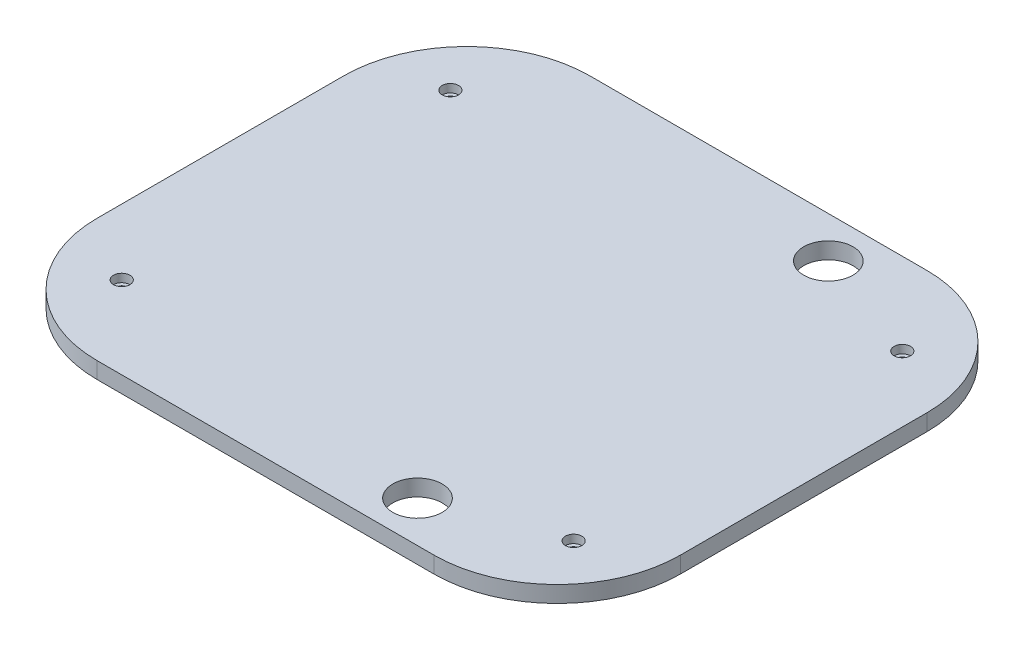
ISO-10303-21;
HEADER;
FILE_DESCRIPTION(('STEP AP214'),'2;1');
FILE_NAME('part.step','',(''),(''),'','','');
FILE_SCHEMA(('AUTOMOTIVE_DESIGN { 1 0 10303 214 1 1 1 1 }'));
ENDSEC;
DATA;
#1=APPLICATION_CONTEXT('core data for automotive mechanical design processes');
#2=APPLICATION_PROTOCOL_DEFINITION('international standard','automotive_design',2000,#1);
#3=PRODUCT_CONTEXT('',#1,'mechanical');
#4=PRODUCT('Part','Part','',(#3));
#5=PRODUCT_RELATED_PRODUCT_CATEGORY('part','',(#4));
#6=PRODUCT_DEFINITION_FORMATION('','',#4);
#7=PRODUCT_DEFINITION_CONTEXT('part definition',#1,'design');
#8=PRODUCT_DEFINITION('design','',#6,#7);
#9=PRODUCT_DEFINITION_SHAPE('','',#8);
#10=(LENGTH_UNIT() NAMED_UNIT(*) SI_UNIT(.MILLI.,.METRE.));
#11=(NAMED_UNIT(*) PLANE_ANGLE_UNIT() SI_UNIT($,.RADIAN.));
#12=(NAMED_UNIT(*) SI_UNIT($,.STERADIAN.) SOLID_ANGLE_UNIT());
#13=UNCERTAINTY_MEASURE_WITH_UNIT(LENGTH_MEASURE(1.E-05),#10,'distance_accuracy_value','');
#14=(GEOMETRIC_REPRESENTATION_CONTEXT(3) GLOBAL_UNCERTAINTY_ASSIGNED_CONTEXT((#13)) GLOBAL_UNIT_ASSIGNED_CONTEXT((#10,
#11,#12)) REPRESENTATION_CONTEXT('',''));
#15=CARTESIAN_POINT('',(0.,0.,0.));
#16=DIRECTION('',(0.,0.,1.));
#17=DIRECTION('',(1.,0.,0.));
#18=AXIS2_PLACEMENT_3D('',#15,#16,#17);
#19=CARTESIAN_POINT('',(0.,10.,0.));
#20=DIRECTION('',(0.,1.,0.));
#21=DIRECTION('',(0.,0.,1.));
#22=AXIS2_PLACEMENT_3D('',#19,#20,#21);
#23=PLANE('',#22);
#24=CARTESIAN_POINT('',(137.5,10.,100.));
#25=DIRECTION('',(0.,1.,0.));
#26=DIRECTION('',(0.,0.,1.));
#27=AXIS2_PLACEMENT_3D('',#24,#25,#26);
#28=CIRCLE('',#27,5.);
#29=CARTESIAN_POINT('',(137.5,10.,105.));
#30=VERTEX_POINT('',#29);
#31=EDGE_CURVE('E230',#30,#30,#28,.T.);
#32=ORIENTED_EDGE('',*,*,#31,.F.);
#33=EDGE_LOOP('',(#32));
#34=FACE_BOUND('',#33,.T.);
#35=CARTESIAN_POINT('',(-137.5,10.,-100.));
#36=DIRECTION('',(0.,1.,0.));
#37=DIRECTION('',(0.,0.,1.));
#38=AXIS2_PLACEMENT_3D('',#35,#36,#37);
#39=CIRCLE('',#38,5.);
#40=CARTESIAN_POINT('',(-137.5,10.,-95.));
#41=VERTEX_POINT('',#40);
#42=EDGE_CURVE('E218',#41,#41,#39,.T.);
#43=ORIENTED_EDGE('',*,*,#42,.F.);
#44=EDGE_LOOP('',(#43));
#45=FACE_BOUND('',#44,.T.);
#46=CARTESIAN_POINT('',(-137.5,10.,100.));
#47=DIRECTION('',(0.,1.,0.));
#48=DIRECTION('',(0.,0.,1.));
#49=AXIS2_PLACEMENT_3D('',#46,#47,#48);
#50=CIRCLE('',#49,5.);
#51=CARTESIAN_POINT('',(-137.5,10.,105.));
#52=VERTEX_POINT('',#51);
#53=EDGE_CURVE('E206',#52,#52,#50,.T.);
#54=ORIENTED_EDGE('',*,*,#53,.F.);
#55=EDGE_LOOP('',(#54));
#56=FACE_BOUND('',#55,.T.);
#57=CARTESIAN_POINT('',(137.5,10.,-100.));
#58=DIRECTION('',(0.,1.,0.));
#59=DIRECTION('',(0.,0.,1.));
#60=AXIS2_PLACEMENT_3D('',#57,#58,#59);
#61=CIRCLE('',#60,5.);
#62=CARTESIAN_POINT('',(137.5,10.,-95.));
#63=VERTEX_POINT('',#62);
#64=EDGE_CURVE('E194',#63,#63,#61,.T.);
#65=ORIENTED_EDGE('',*,*,#64,.F.);
#66=EDGE_LOOP('',(#65));
#67=FACE_BOUND('',#66,.T.);
#68=CARTESIAN_POINT('',(67.5,10.,125.));
#69=DIRECTION('',(0.,1.,0.));
#70=DIRECTION('',(0.,0.,1.));
#71=AXIS2_PLACEMENT_3D('',#68,#69,#70);
#72=CIRCLE('',#71,15.);
#73=CARTESIAN_POINT('',(67.5,10.,140.));
#74=VERTEX_POINT('',#73);
#75=EDGE_CURVE('E166',#74,#74,#72,.T.);
#76=ORIENTED_EDGE('',*,*,#75,.F.);
#77=EDGE_LOOP('',(#76));
#78=FACE_BOUND('',#77,.T.);
#79=DIRECTION('',(1.,0.,0.));
#80=VECTOR('',#79,1.);
#81=CARTESIAN_POINT('',(-177.5,10.,150.));
#82=LINE('',#81,#80);
#83=CARTESIAN_POINT('',(-102.5,10.,150.));
#84=VERTEX_POINT('',#83);
#85=CARTESIAN_POINT('',(102.5,10.,150.));
#86=VERTEX_POINT('',#85);
#87=EDGE_CURVE('E170',#84,#86,#82,.T.);
#88=ORIENTED_EDGE('',*,*,#87,.T.);
#89=CARTESIAN_POINT('',(102.5,10.,75.));
#90=DIRECTION('',(0.,1.,0.));
#91=DIRECTION('',(0.,0.,1.));
#92=AXIS2_PLACEMENT_3D('',#89,#90,#91);
#93=CIRCLE('',#92,75.);
#94=CARTESIAN_POINT('',(177.5,10.,75.));
#95=VERTEX_POINT('',#94);
#96=EDGE_CURVE('E153',#86,#95,#93,.T.);
#97=ORIENTED_EDGE('',*,*,#96,.T.);
#98=DIRECTION('',(0.,0.,-1.));
#99=VECTOR('',#98,1.);
#100=CARTESIAN_POINT('',(177.5,10.,150.));
#101=LINE('',#100,#99);
#102=CARTESIAN_POINT('',(177.5,10.,-75.));
#103=VERTEX_POINT('',#102);
#104=EDGE_CURVE('E124',#95,#103,#101,.T.);
#105=ORIENTED_EDGE('',*,*,#104,.T.);
#106=CARTESIAN_POINT('',(102.5,10.,-75.));
#107=DIRECTION('',(0.,1.,0.));
#108=DIRECTION('',(0.,0.,1.));
#109=AXIS2_PLACEMENT_3D('',#106,#107,#108);
#110=CIRCLE('',#109,75.);
#111=CARTESIAN_POINT('',(102.5,10.,-150.));
#112=VERTEX_POINT('',#111);
#113=EDGE_CURVE('E151',#103,#112,#110,.T.);
#114=ORIENTED_EDGE('',*,*,#113,.T.);
#115=DIRECTION('',(-1.,0.,0.));
#116=VECTOR('',#115,1.);
#117=CARTESIAN_POINT('',(177.5,10.,-150.));
#118=LINE('',#117,#116);
#119=CARTESIAN_POINT('',(-102.5,10.,-150.));
#120=VERTEX_POINT('',#119);
#121=EDGE_CURVE('E131',#112,#120,#118,.T.);
#122=ORIENTED_EDGE('',*,*,#121,.T.);
#123=CARTESIAN_POINT('',(-102.5,10.,-75.));
#124=DIRECTION('',(0.,1.,0.));
#125=DIRECTION('',(0.,0.,1.));
#126=AXIS2_PLACEMENT_3D('',#123,#124,#125);
#127=CIRCLE('',#126,75.);
#128=CARTESIAN_POINT('',(-177.5,10.,-75.));
#129=VERTEX_POINT('',#128);
#130=EDGE_CURVE('E59',#120,#129,#127,.T.);
#131=ORIENTED_EDGE('',*,*,#130,.T.);
#132=DIRECTION('',(0.,0.,1.));
#133=VECTOR('',#132,1.);
#134=CARTESIAN_POINT('',(-177.5,10.,-150.));
#135=LINE('',#134,#133);
#136=CARTESIAN_POINT('',(-177.5,10.,75.));
#137=VERTEX_POINT('',#136);
#138=EDGE_CURVE('E134',#129,#137,#135,.T.);
#139=ORIENTED_EDGE('',*,*,#138,.T.);
#140=CARTESIAN_POINT('',(-102.5,10.,75.));
#141=DIRECTION('',(0.,1.,0.));
#142=DIRECTION('',(0.,0.,1.));
#143=AXIS2_PLACEMENT_3D('',#140,#141,#142);
#144=CIRCLE('',#143,75.);
#145=EDGE_CURVE('E149',#137,#84,#144,.T.);
#146=ORIENTED_EDGE('',*,*,#145,.T.);
#147=EDGE_LOOP('',(#88,#97,#105,#114,#122,#131,#139,#146));
#148=FACE_BOUND('',#147,.T.);
#149=CARTESIAN_POINT('',(67.5,10.,-125.));
#150=DIRECTION('',(0.,1.,0.));
#151=DIRECTION('',(0.,0.,1.));
#152=AXIS2_PLACEMENT_3D('',#149,#150,#151);
#153=CIRCLE('',#152,15.);
#154=CARTESIAN_POINT('',(67.5,10.,-110.));
#155=VERTEX_POINT('',#154);
#156=EDGE_CURVE('E177',#155,#155,#153,.T.);
#157=ORIENTED_EDGE('',*,*,#156,.F.);
#158=EDGE_LOOP('',(#157));
#159=FACE_BOUND('',#158,.T.);
#160=ADVANCED_FACE('F39',(#34,#45,#56,#67,#78,#148,#159),#23,.T.);
#161=CARTESIAN_POINT('',(0.,0.,0.));
#162=DIRECTION('',(0.,1.,0.));
#163=DIRECTION('',(0.,0.,1.));
#164=AXIS2_PLACEMENT_3D('',#161,#162,#163);
#165=PLANE('',#164);
#166=CARTESIAN_POINT('',(137.5,0.,100.));
#167=DIRECTION('',(0.,1.,0.));
#168=DIRECTION('',(0.,0.,1.));
#169=AXIS2_PLACEMENT_3D('',#166,#167,#168);
#170=CIRCLE('',#169,2.75);
#171=CARTESIAN_POINT('',(137.5,0.,102.75));
#172=VERTEX_POINT('',#171);
#173=EDGE_CURVE('E221',#172,#172,#170,.T.);
#174=ORIENTED_EDGE('',*,*,#173,.T.);
#175=EDGE_LOOP('',(#174));
#176=FACE_BOUND('',#175,.T.);
#177=CARTESIAN_POINT('',(-137.5,0.,-100.));
#178=DIRECTION('',(0.,1.,0.));
#179=DIRECTION('',(0.,0.,1.));
#180=AXIS2_PLACEMENT_3D('',#177,#178,#179);
#181=CIRCLE('',#180,2.75);
#182=CARTESIAN_POINT('',(-137.5,0.,-97.25));
#183=VERTEX_POINT('',#182);
#184=EDGE_CURVE('E209',#183,#183,#181,.T.);
#185=ORIENTED_EDGE('',*,*,#184,.T.);
#186=EDGE_LOOP('',(#185));
#187=FACE_BOUND('',#186,.T.);
#188=CARTESIAN_POINT('',(-137.5,0.,100.));
#189=DIRECTION('',(0.,1.,0.));
#190=DIRECTION('',(0.,0.,1.));
#191=AXIS2_PLACEMENT_3D('',#188,#189,#190);
#192=CIRCLE('',#191,2.75);
#193=CARTESIAN_POINT('',(-137.5,0.,102.75));
#194=VERTEX_POINT('',#193);
#195=EDGE_CURVE('E197',#194,#194,#192,.T.);
#196=ORIENTED_EDGE('',*,*,#195,.T.);
#197=EDGE_LOOP('',(#196));
#198=FACE_BOUND('',#197,.T.);
#199=CARTESIAN_POINT('',(137.5,0.,-100.));
#200=DIRECTION('',(0.,1.,0.));
#201=DIRECTION('',(0.,0.,1.));
#202=AXIS2_PLACEMENT_3D('',#199,#200,#201);
#203=CIRCLE('',#202,2.75);
#204=CARTESIAN_POINT('',(137.5,0.,-97.25));
#205=VERTEX_POINT('',#204);
#206=EDGE_CURVE('E183',#205,#205,#203,.T.);
#207=ORIENTED_EDGE('',*,*,#206,.T.);
#208=EDGE_LOOP('',(#207));
#209=FACE_BOUND('',#208,.T.);
#210=DIRECTION('',(0.,0.,-1.));
#211=VECTOR('',#210,1.);
#212=CARTESIAN_POINT('',(177.5,0.,150.));
#213=LINE('',#212,#211);
#214=CARTESIAN_POINT('',(177.5,0.,75.));
#215=VERTEX_POINT('',#214);
#216=CARTESIAN_POINT('',(177.5,0.,-75.));
#217=VERTEX_POINT('',#216);
#218=EDGE_CURVE('E121',#215,#217,#213,.T.);
#219=ORIENTED_EDGE('',*,*,#218,.F.);
#220=CARTESIAN_POINT('',(102.5,0.,75.));
#221=DIRECTION('',(0.,1.,0.));
#222=DIRECTION('',(0.,0.,1.));
#223=AXIS2_PLACEMENT_3D('',#220,#221,#222);
#224=CIRCLE('',#223,75.);
#225=CARTESIAN_POINT('',(102.5,0.,150.));
#226=VERTEX_POINT('',#225);
#227=EDGE_CURVE('E104',#215,#226,#224,.F.);
#228=ORIENTED_EDGE('',*,*,#227,.T.);
#229=DIRECTION('',(1.,0.,0.));
#230=VECTOR('',#229,1.);
#231=CARTESIAN_POINT('',(-177.5,0.,150.));
#232=LINE('',#231,#230);
#233=CARTESIAN_POINT('',(-102.5,0.,150.));
#234=VERTEX_POINT('',#233);
#235=EDGE_CURVE('E132',#234,#226,#232,.T.);
#236=ORIENTED_EDGE('',*,*,#235,.F.);
#237=CARTESIAN_POINT('',(-102.5,0.,75.));
#238=DIRECTION('',(0.,1.,0.));
#239=DIRECTION('',(0.,0.,1.));
#240=AXIS2_PLACEMENT_3D('',#237,#238,#239);
#241=CIRCLE('',#240,75.);
#242=CARTESIAN_POINT('',(-177.5,0.,75.));
#243=VERTEX_POINT('',#242);
#244=EDGE_CURVE('E142',#234,#243,#241,.F.);
#245=ORIENTED_EDGE('',*,*,#244,.T.);
#246=DIRECTION('',(0.,0.,1.));
#247=VECTOR('',#246,1.);
#248=CARTESIAN_POINT('',(-177.5,0.,-150.));
#249=LINE('',#248,#247);
#250=CARTESIAN_POINT('',(-177.5,0.,-75.));
#251=VERTEX_POINT('',#250);
#252=EDGE_CURVE('E136',#251,#243,#249,.T.);
#253=ORIENTED_EDGE('',*,*,#252,.F.);
#254=CARTESIAN_POINT('',(-102.5,0.,-75.));
#255=DIRECTION('',(0.,1.,0.));
#256=DIRECTION('',(0.,0.,1.));
#257=AXIS2_PLACEMENT_3D('',#254,#255,#256);
#258=CIRCLE('',#257,75.);
#259=CARTESIAN_POINT('',(-102.5,0.,-150.));
#260=VERTEX_POINT('',#259);
#261=EDGE_CURVE('E125',#251,#260,#258,.F.);
#262=ORIENTED_EDGE('',*,*,#261,.T.);
#263=DIRECTION('',(-1.,0.,0.));
#264=VECTOR('',#263,1.);
#265=CARTESIAN_POINT('',(177.5,0.,-150.));
#266=LINE('',#265,#264);
#267=CARTESIAN_POINT('',(102.5,0.,-150.));
#268=VERTEX_POINT('',#267);
#269=EDGE_CURVE('E165',#268,#260,#266,.T.);
#270=ORIENTED_EDGE('',*,*,#269,.F.);
#271=CARTESIAN_POINT('',(102.5,0.,-75.));
#272=DIRECTION('',(0.,1.,0.));
#273=DIRECTION('',(0.,0.,1.));
#274=AXIS2_PLACEMENT_3D('',#271,#272,#273);
#275=CIRCLE('',#274,75.);
#276=EDGE_CURVE('E115',#268,#217,#275,.F.);
#277=ORIENTED_EDGE('',*,*,#276,.T.);
#278=EDGE_LOOP('',(#219,#228,#236,#245,#253,#262,#270,#277));
#279=FACE_BOUND('',#278,.T.);
#280=CARTESIAN_POINT('',(67.5,0.,125.));
#281=DIRECTION('',(0.,1.,0.));
#282=DIRECTION('',(0.,0.,1.));
#283=AXIS2_PLACEMENT_3D('',#280,#281,#282);
#284=CIRCLE('',#283,15.);
#285=CARTESIAN_POINT('',(67.5,0.,140.));
#286=VERTEX_POINT('',#285);
#287=EDGE_CURVE('E174',#286,#286,#284,.T.);
#288=ORIENTED_EDGE('',*,*,#287,.T.);
#289=EDGE_LOOP('',(#288));
#290=FACE_BOUND('',#289,.T.);
#291=CARTESIAN_POINT('',(67.5,0.,-125.));
#292=DIRECTION('',(0.,1.,0.));
#293=DIRECTION('',(0.,0.,1.));
#294=AXIS2_PLACEMENT_3D('',#291,#292,#293);
#295=CIRCLE('',#294,15.);
#296=CARTESIAN_POINT('',(67.5,0.,-110.));
#297=VERTEX_POINT('',#296);
#298=EDGE_CURVE('E180',#297,#297,#295,.T.);
#299=ORIENTED_EDGE('',*,*,#298,.T.);
#300=EDGE_LOOP('',(#299));
#301=FACE_BOUND('',#300,.T.);
#302=ADVANCED_FACE('F128',(#176,#187,#198,#209,#279,#290,#301),#165,.F.);
#303=CARTESIAN_POINT('',(177.5,10.,-150.));
#304=DIRECTION('',(0.,0.,1.));
#305=DIRECTION('',(1.,0.,0.));
#306=AXIS2_PLACEMENT_3D('',#303,#304,#305);
#307=PLANE('',#306);
#308=ORIENTED_EDGE('',*,*,#121,.F.);
#309=DIRECTION('',(0.,-1.,0.));
#310=VECTOR('',#309,1.);
#311=CARTESIAN_POINT('',(102.5,10.,-150.));
#312=LINE('',#311,#310);
#313=EDGE_CURVE('E157',#112,#268,#312,.T.);
#314=ORIENTED_EDGE('',*,*,#313,.T.);
#315=ORIENTED_EDGE('',*,*,#269,.T.);
#316=DIRECTION('',(0.,-1.,0.));
#317=VECTOR('',#316,1.);
#318=CARTESIAN_POINT('',(-102.5,10.,-150.));
#319=LINE('',#318,#317);
#320=EDGE_CURVE('E155',#260,#120,#319,.F.);
#321=ORIENTED_EDGE('',*,*,#320,.T.);
#322=EDGE_LOOP('',(#308,#314,#315,#321));
#323=FACE_BOUND('',#322,.T.);
#324=ADVANCED_FACE('F259',(#323),#307,.F.);
#325=CARTESIAN_POINT('',(-177.5,10.,-150.));
#326=DIRECTION('',(1.,0.,0.));
#327=DIRECTION('',(0.,0.,-1.));
#328=AXIS2_PLACEMENT_3D('',#325,#326,#327);
#329=PLANE('',#328);
#330=ORIENTED_EDGE('',*,*,#252,.T.);
#331=DIRECTION('',(0.,-1.,0.));
#332=VECTOR('',#331,1.);
#333=CARTESIAN_POINT('',(-177.5,10.,75.));
#334=LINE('',#333,#332);
#335=EDGE_CURVE('E11',#243,#137,#334,.F.);
#336=ORIENTED_EDGE('',*,*,#335,.T.);
#337=ORIENTED_EDGE('',*,*,#138,.F.);
#338=DIRECTION('',(0.,-1.,0.));
#339=VECTOR('',#338,1.);
#340=CARTESIAN_POINT('',(-177.5,10.,-75.));
#341=LINE('',#340,#339);
#342=EDGE_CURVE('E47',#129,#251,#341,.T.);
#343=ORIENTED_EDGE('',*,*,#342,.T.);
#344=EDGE_LOOP('',(#330,#336,#337,#343));
#345=FACE_BOUND('',#344,.T.);
#346=ADVANCED_FACE('F162',(#345),#329,.F.);
#347=CARTESIAN_POINT('',(-177.5,10.,150.));
#348=DIRECTION('',(0.,0.,-1.));
#349=DIRECTION('',(-1.,0.,0.));
#350=AXIS2_PLACEMENT_3D('',#347,#348,#349);
#351=PLANE('',#350);
#352=ORIENTED_EDGE('',*,*,#235,.T.);
#353=DIRECTION('',(0.,-1.,0.));
#354=VECTOR('',#353,1.);
#355=CARTESIAN_POINT('',(102.5,10.,150.));
#356=LINE('',#355,#354);
#357=EDGE_CURVE('E109',#226,#86,#356,.F.);
#358=ORIENTED_EDGE('',*,*,#357,.T.);
#359=ORIENTED_EDGE('',*,*,#87,.F.);
#360=DIRECTION('',(0.,-1.,0.));
#361=VECTOR('',#360,1.);
#362=CARTESIAN_POINT('',(-102.5,10.,150.));
#363=LINE('',#362,#361);
#364=EDGE_CURVE('E114',#84,#234,#363,.T.);
#365=ORIENTED_EDGE('',*,*,#364,.T.);
#366=EDGE_LOOP('',(#352,#358,#359,#365));
#367=FACE_BOUND('',#366,.T.);
#368=ADVANCED_FACE('F272',(#367),#351,.F.);
#369=CARTESIAN_POINT('',(177.5,10.,150.));
#370=DIRECTION('',(-1.,0.,0.));
#371=DIRECTION('',(0.,0.,1.));
#372=AXIS2_PLACEMENT_3D('',#369,#370,#371);
#373=PLANE('',#372);
#374=ORIENTED_EDGE('',*,*,#104,.F.);
#375=DIRECTION('',(0.,-1.,0.));
#376=VECTOR('',#375,1.);
#377=CARTESIAN_POINT('',(177.5,10.,75.));
#378=LINE('',#377,#376);
#379=EDGE_CURVE('E108',#95,#215,#378,.T.);
#380=ORIENTED_EDGE('',*,*,#379,.T.);
#381=ORIENTED_EDGE('',*,*,#218,.T.);
#382=DIRECTION('',(0.,-1.,0.));
#383=VECTOR('',#382,1.);
#384=CARTESIAN_POINT('',(177.5,10.,-75.));
#385=LINE('',#384,#383);
#386=EDGE_CURVE('E126',#217,#103,#385,.F.);
#387=ORIENTED_EDGE('',*,*,#386,.T.);
#388=EDGE_LOOP('',(#374,#380,#381,#387));
#389=FACE_BOUND('',#388,.T.);
#390=ADVANCED_FACE('F120',(#389),#373,.F.);
#391=CARTESIAN_POINT('',(67.5,10.,125.));
#392=DIRECTION('',(0.,-1.,0.));
#393=DIRECTION('',(0.,0.,-1.));
#394=AXIS2_PLACEMENT_3D('',#391,#392,#393);
#395=CYLINDRICAL_SURFACE('',#394,15.);
#396=ORIENTED_EDGE('',*,*,#75,.T.);
#397=EDGE_LOOP('',(#396));
#398=FACE_BOUND('',#397,.T.);
#399=ORIENTED_EDGE('',*,*,#287,.F.);
#400=EDGE_LOOP('',(#399));
#401=FACE_BOUND('',#400,.T.);
#402=ADVANCED_FACE('F254',(#398,#401),#395,.F.);
#403=CARTESIAN_POINT('',(67.5,10.,-125.));
#404=DIRECTION('',(0.,-1.,0.));
#405=DIRECTION('',(0.,0.,-1.));
#406=AXIS2_PLACEMENT_3D('',#403,#404,#405);
#407=CYLINDRICAL_SURFACE('',#406,15.);
#408=ORIENTED_EDGE('',*,*,#156,.T.);
#409=EDGE_LOOP('',(#408));
#410=FACE_BOUND('',#409,.T.);
#411=ORIENTED_EDGE('',*,*,#298,.F.);
#412=EDGE_LOOP('',(#411));
#413=FACE_BOUND('',#412,.T.);
#414=ADVANCED_FACE('F250',(#410,#413),#407,.F.);
#415=CARTESIAN_POINT('',(137.5,10.,-100.));
#416=DIRECTION('',(0.,1.,0.));
#417=DIRECTION('',(0.,0.,1.));
#418=AXIS2_PLACEMENT_3D('',#415,#416,#417);
#419=CYLINDRICAL_SURFACE('',#418,2.75);
#420=ORIENTED_EDGE('',*,*,#206,.F.);
#421=EDGE_LOOP('',(#420));
#422=FACE_BOUND('',#421,.T.);
#423=CARTESIAN_POINT('',(137.5,5.,-100.));
#424=DIRECTION('',(0.,1.,0.));
#425=DIRECTION('',(0.,0.,1.));
#426=AXIS2_PLACEMENT_3D('',#423,#424,#425);
#427=CIRCLE('',#426,2.75);
#428=CARTESIAN_POINT('',(137.5,5.,-97.25));
#429=VERTEX_POINT('',#428);
#430=EDGE_CURVE('E188',#429,#429,#427,.T.);
#431=ORIENTED_EDGE('',*,*,#430,.T.);
#432=EDGE_LOOP('',(#431));
#433=FACE_BOUND('',#432,.T.);
#434=ADVANCED_FACE('F253',(#422,#433),#419,.F.);
#435=CARTESIAN_POINT('',(140.25,5.,-100.));
#436=DIRECTION('',(0.,-1.,0.));
#437=DIRECTION('',(0.,0.,-1.));
#438=AXIS2_PLACEMENT_3D('',#435,#436,#437);
#439=PLANE('',#438);
#440=ORIENTED_EDGE('',*,*,#430,.F.);
#441=EDGE_LOOP('',(#440));
#442=FACE_BOUND('',#441,.T.);
#443=CARTESIAN_POINT('',(137.5,5.,-100.));
#444=DIRECTION('',(0.,1.,0.));
#445=DIRECTION('',(0.,0.,1.));
#446=AXIS2_PLACEMENT_3D('',#443,#444,#445);
#447=CIRCLE('',#446,5.);
#448=CARTESIAN_POINT('',(137.5,5.,-95.));
#449=VERTEX_POINT('',#448);
#450=EDGE_CURVE('E191',#449,#449,#447,.T.);
#451=ORIENTED_EDGE('',*,*,#450,.T.);
#452=EDGE_LOOP('',(#451));
#453=FACE_BOUND('',#452,.T.);
#454=ADVANCED_FACE('F413',(#442,#453),#439,.F.);
#455=CARTESIAN_POINT('',(137.5,10.,-100.));
#456=DIRECTION('',(0.,1.,0.));
#457=DIRECTION('',(0.,0.,1.));
#458=AXIS2_PLACEMENT_3D('',#455,#456,#457);
#459=CYLINDRICAL_SURFACE('',#458,5.);
#460=ORIENTED_EDGE('',*,*,#450,.F.);
#461=EDGE_LOOP('',(#460));
#462=FACE_BOUND('',#461,.T.);
#463=ORIENTED_EDGE('',*,*,#64,.T.);
#464=EDGE_LOOP('',(#463));
#465=FACE_BOUND('',#464,.T.);
#466=ADVANCED_FACE('F403',(#462,#465),#459,.F.);
#467=CARTESIAN_POINT('',(-137.5,10.,100.));
#468=DIRECTION('',(0.,1.,0.));
#469=DIRECTION('',(0.,0.,1.));
#470=AXIS2_PLACEMENT_3D('',#467,#468,#469);
#471=CYLINDRICAL_SURFACE('',#470,2.75);
#472=ORIENTED_EDGE('',*,*,#195,.F.);
#473=EDGE_LOOP('',(#472));
#474=FACE_BOUND('',#473,.T.);
#475=CARTESIAN_POINT('',(-137.5,5.,100.));
#476=DIRECTION('',(0.,1.,0.));
#477=DIRECTION('',(0.,0.,1.));
#478=AXIS2_PLACEMENT_3D('',#475,#476,#477);
#479=CIRCLE('',#478,2.75);
#480=CARTESIAN_POINT('',(-137.5,5.,102.75));
#481=VERTEX_POINT('',#480);
#482=EDGE_CURVE('E200',#481,#481,#479,.T.);
#483=ORIENTED_EDGE('',*,*,#482,.T.);
#484=EDGE_LOOP('',(#483));
#485=FACE_BOUND('',#484,.T.);
#486=ADVANCED_FACE('F393',(#474,#485),#471,.F.);
#487=CARTESIAN_POINT('',(-134.75,5.,100.));
#488=DIRECTION('',(0.,-1.,0.));
#489=DIRECTION('',(0.,0.,-1.));
#490=AXIS2_PLACEMENT_3D('',#487,#488,#489);
#491=PLANE('',#490);
#492=ORIENTED_EDGE('',*,*,#482,.F.);
#493=EDGE_LOOP('',(#492));
#494=FACE_BOUND('',#493,.T.);
#495=CARTESIAN_POINT('',(-137.5,5.,100.));
#496=DIRECTION('',(0.,1.,0.));
#497=DIRECTION('',(0.,0.,1.));
#498=AXIS2_PLACEMENT_3D('',#495,#496,#497);
#499=CIRCLE('',#498,5.);
#500=CARTESIAN_POINT('',(-137.5,5.,105.));
#501=VERTEX_POINT('',#500);
#502=EDGE_CURVE('E203',#501,#501,#499,.T.);
#503=ORIENTED_EDGE('',*,*,#502,.T.);
#504=EDGE_LOOP('',(#503));
#505=FACE_BOUND('',#504,.T.);
#506=ADVANCED_FACE('F383',(#494,#505),#491,.F.);
#507=CARTESIAN_POINT('',(-137.5,10.,100.));
#508=DIRECTION('',(0.,1.,0.));
#509=DIRECTION('',(0.,0.,1.));
#510=AXIS2_PLACEMENT_3D('',#507,#508,#509);
#511=CYLINDRICAL_SURFACE('',#510,5.);
#512=ORIENTED_EDGE('',*,*,#502,.F.);
#513=EDGE_LOOP('',(#512));
#514=FACE_BOUND('',#513,.T.);
#515=ORIENTED_EDGE('',*,*,#53,.T.);
#516=EDGE_LOOP('',(#515));
#517=FACE_BOUND('',#516,.T.);
#518=ADVANCED_FACE('F373',(#514,#517),#511,.F.);
#519=CARTESIAN_POINT('',(-137.5,10.,-100.));
#520=DIRECTION('',(0.,1.,0.));
#521=DIRECTION('',(0.,0.,1.));
#522=AXIS2_PLACEMENT_3D('',#519,#520,#521);
#523=CYLINDRICAL_SURFACE('',#522,2.75);
#524=ORIENTED_EDGE('',*,*,#184,.F.);
#525=EDGE_LOOP('',(#524));
#526=FACE_BOUND('',#525,.T.);
#527=CARTESIAN_POINT('',(-137.5,5.,-100.));
#528=DIRECTION('',(0.,1.,0.));
#529=DIRECTION('',(0.,0.,1.));
#530=AXIS2_PLACEMENT_3D('',#527,#528,#529);
#531=CIRCLE('',#530,2.75);
#532=CARTESIAN_POINT('',(-137.5,5.,-97.25));
#533=VERTEX_POINT('',#532);
#534=EDGE_CURVE('E212',#533,#533,#531,.T.);
#535=ORIENTED_EDGE('',*,*,#534,.T.);
#536=EDGE_LOOP('',(#535));
#537=FACE_BOUND('',#536,.T.);
#538=ADVANCED_FACE('F363',(#526,#537),#523,.F.);
#539=CARTESIAN_POINT('',(-134.75,5.,-100.));
#540=DIRECTION('',(0.,-1.,0.));
#541=DIRECTION('',(0.,0.,-1.));
#542=AXIS2_PLACEMENT_3D('',#539,#540,#541);
#543=PLANE('',#542);
#544=ORIENTED_EDGE('',*,*,#534,.F.);
#545=EDGE_LOOP('',(#544));
#546=FACE_BOUND('',#545,.T.);
#547=CARTESIAN_POINT('',(-137.5,5.,-100.));
#548=DIRECTION('',(0.,1.,0.));
#549=DIRECTION('',(0.,0.,1.));
#550=AXIS2_PLACEMENT_3D('',#547,#548,#549);
#551=CIRCLE('',#550,5.);
#552=CARTESIAN_POINT('',(-137.5,5.,-95.));
#553=VERTEX_POINT('',#552);
#554=EDGE_CURVE('E215',#553,#553,#551,.T.);
#555=ORIENTED_EDGE('',*,*,#554,.T.);
#556=EDGE_LOOP('',(#555));
#557=FACE_BOUND('',#556,.T.);
#558=ADVANCED_FACE('F353',(#546,#557),#543,.F.);
#559=CARTESIAN_POINT('',(-137.5,10.,-100.));
#560=DIRECTION('',(0.,1.,0.));
#561=DIRECTION('',(0.,0.,1.));
#562=AXIS2_PLACEMENT_3D('',#559,#560,#561);
#563=CYLINDRICAL_SURFACE('',#562,5.);
#564=ORIENTED_EDGE('',*,*,#554,.F.);
#565=EDGE_LOOP('',(#564));
#566=FACE_BOUND('',#565,.T.);
#567=ORIENTED_EDGE('',*,*,#42,.T.);
#568=EDGE_LOOP('',(#567));
#569=FACE_BOUND('',#568,.T.);
#570=ADVANCED_FACE('F343',(#566,#569),#563,.F.);
#571=CARTESIAN_POINT('',(137.5,10.,100.));
#572=DIRECTION('',(0.,1.,0.));
#573=DIRECTION('',(0.,0.,1.));
#574=AXIS2_PLACEMENT_3D('',#571,#572,#573);
#575=CYLINDRICAL_SURFACE('',#574,2.75);
#576=ORIENTED_EDGE('',*,*,#173,.F.);
#577=EDGE_LOOP('',(#576));
#578=FACE_BOUND('',#577,.T.);
#579=CARTESIAN_POINT('',(137.5,5.,100.));
#580=DIRECTION('',(0.,1.,0.));
#581=DIRECTION('',(0.,0.,1.));
#582=AXIS2_PLACEMENT_3D('',#579,#580,#581);
#583=CIRCLE('',#582,2.75);
#584=CARTESIAN_POINT('',(137.5,5.,102.75));
#585=VERTEX_POINT('',#584);
#586=EDGE_CURVE('E224',#585,#585,#583,.T.);
#587=ORIENTED_EDGE('',*,*,#586,.T.);
#588=EDGE_LOOP('',(#587));
#589=FACE_BOUND('',#588,.T.);
#590=ADVANCED_FACE('F333',(#578,#589),#575,.F.);
#591=CARTESIAN_POINT('',(140.25,5.,100.));
#592=DIRECTION('',(0.,-1.,0.));
#593=DIRECTION('',(0.,0.,-1.));
#594=AXIS2_PLACEMENT_3D('',#591,#592,#593);
#595=PLANE('',#594);
#596=ORIENTED_EDGE('',*,*,#586,.F.);
#597=EDGE_LOOP('',(#596));
#598=FACE_BOUND('',#597,.T.);
#599=CARTESIAN_POINT('',(137.5,5.,100.));
#600=DIRECTION('',(0.,1.,0.));
#601=DIRECTION('',(0.,0.,1.));
#602=AXIS2_PLACEMENT_3D('',#599,#600,#601);
#603=CIRCLE('',#602,5.);
#604=CARTESIAN_POINT('',(137.5,5.,105.));
#605=VERTEX_POINT('',#604);
#606=EDGE_CURVE('E227',#605,#605,#603,.T.);
#607=ORIENTED_EDGE('',*,*,#606,.T.);
#608=EDGE_LOOP('',(#607));
#609=FACE_BOUND('',#608,.T.);
#610=ADVANCED_FACE('F323',(#598,#609),#595,.F.);
#611=CARTESIAN_POINT('',(137.5,10.,100.));
#612=DIRECTION('',(0.,1.,0.));
#613=DIRECTION('',(0.,0.,1.));
#614=AXIS2_PLACEMENT_3D('',#611,#612,#613);
#615=CYLINDRICAL_SURFACE('',#614,5.);
#616=ORIENTED_EDGE('',*,*,#606,.F.);
#617=EDGE_LOOP('',(#616));
#618=FACE_BOUND('',#617,.T.);
#619=ORIENTED_EDGE('',*,*,#31,.T.);
#620=EDGE_LOOP('',(#619));
#621=FACE_BOUND('',#620,.T.);
#622=ADVANCED_FACE('F234',(#618,#621),#615,.F.);
#623=CARTESIAN_POINT('',(102.5,10.,75.));
#624=DIRECTION('',(0.,-1.,0.));
#625=DIRECTION('',(0.,0.,-1.));
#626=AXIS2_PLACEMENT_3D('',#623,#624,#625);
#627=CYLINDRICAL_SURFACE('',#626,75.);
#628=ORIENTED_EDGE('',*,*,#96,.F.);
#629=ORIENTED_EDGE('',*,*,#357,.F.);
#630=ORIENTED_EDGE('',*,*,#227,.F.);
#631=ORIENTED_EDGE('',*,*,#379,.F.);
#632=EDGE_LOOP('',(#628,#629,#630,#631));
#633=FACE_BOUND('',#632,.T.);
#634=ADVANCED_FACE('F107',(#633),#627,.T.);
#635=CARTESIAN_POINT('',(102.5,10.,-75.));
#636=DIRECTION('',(0.,-1.,0.));
#637=DIRECTION('',(0.,0.,-1.));
#638=AXIS2_PLACEMENT_3D('',#635,#636,#637);
#639=CYLINDRICAL_SURFACE('',#638,75.);
#640=ORIENTED_EDGE('',*,*,#113,.F.);
#641=ORIENTED_EDGE('',*,*,#386,.F.);
#642=ORIENTED_EDGE('',*,*,#276,.F.);
#643=ORIENTED_EDGE('',*,*,#313,.F.);
#644=EDGE_LOOP('',(#640,#641,#642,#643));
#645=FACE_BOUND('',#644,.T.);
#646=ADVANCED_FACE('F280',(#645),#639,.T.);
#647=CARTESIAN_POINT('',(-102.5,10.,75.));
#648=DIRECTION('',(0.,-1.,0.));
#649=DIRECTION('',(0.,0.,-1.));
#650=AXIS2_PLACEMENT_3D('',#647,#648,#649);
#651=CYLINDRICAL_SURFACE('',#650,75.);
#652=ORIENTED_EDGE('',*,*,#145,.F.);
#653=ORIENTED_EDGE('',*,*,#335,.F.);
#654=ORIENTED_EDGE('',*,*,#244,.F.);
#655=ORIENTED_EDGE('',*,*,#364,.F.);
#656=EDGE_LOOP('',(#652,#653,#654,#655));
#657=FACE_BOUND('',#656,.T.);
#658=ADVANCED_FACE('F282',(#657),#651,.T.);
#659=CARTESIAN_POINT('',(-102.5,10.,-75.));
#660=DIRECTION('',(0.,-1.,0.));
#661=DIRECTION('',(0.,0.,-1.));
#662=AXIS2_PLACEMENT_3D('',#659,#660,#661);
#663=CYLINDRICAL_SURFACE('',#662,75.);
#664=ORIENTED_EDGE('',*,*,#130,.F.);
#665=ORIENTED_EDGE('',*,*,#320,.F.);
#666=ORIENTED_EDGE('',*,*,#261,.F.);
#667=ORIENTED_EDGE('',*,*,#342,.F.);
#668=EDGE_LOOP('',(#664,#665,#666,#667));
#669=FACE_BOUND('',#668,.T.);
#670=ADVANCED_FACE('F41',(#669),#663,.T.);
#671=CLOSED_SHELL('',(#160,#302,#324,#346,#368,#390,#402,#414,#434,#454,#466,#486,#506,#518,
#538,#558,#570,#590,#610,#622,#634,#646,#658,#670));
#672=MANIFOLD_SOLID_BREP('B2',#671);
#673=ADVANCED_BREP_SHAPE_REPRESENTATION('',(#18,#672),#14);
#674=SHAPE_DEFINITION_REPRESENTATION(#9,#673);
ENDSEC;
END-ISO-10303-21;
